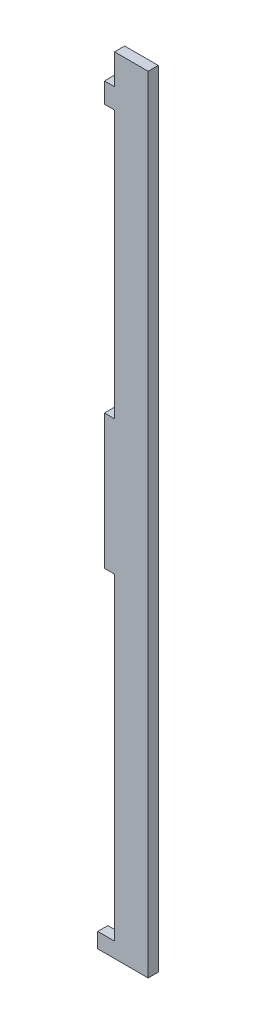
ISO-10303-21;
HEADER;
FILE_DESCRIPTION(('STEP AP214'),'2;1');
FILE_NAME('part.step','',(''),(''),'','','');
FILE_SCHEMA(('AUTOMOTIVE_DESIGN { 1 0 10303 214 1 1 1 1 }'));
ENDSEC;
DATA;
#1=APPLICATION_CONTEXT('core data for automotive mechanical design processes');
#2=APPLICATION_PROTOCOL_DEFINITION('international standard','automotive_design',2000,#1);
#3=PRODUCT_CONTEXT('',#1,'mechanical');
#4=PRODUCT('Part','Part','',(#3));
#5=PRODUCT_RELATED_PRODUCT_CATEGORY('part','',(#4));
#6=PRODUCT_DEFINITION_FORMATION('','',#4);
#7=PRODUCT_DEFINITION_CONTEXT('part definition',#1,'design');
#8=PRODUCT_DEFINITION('design','',#6,#7);
#9=PRODUCT_DEFINITION_SHAPE('','',#8);
#10=(LENGTH_UNIT() NAMED_UNIT(*) SI_UNIT(.MILLI.,.METRE.));
#11=(NAMED_UNIT(*) PLANE_ANGLE_UNIT() SI_UNIT($,.RADIAN.));
#12=(NAMED_UNIT(*) SI_UNIT($,.STERADIAN.) SOLID_ANGLE_UNIT());
#13=UNCERTAINTY_MEASURE_WITH_UNIT(LENGTH_MEASURE(1.E-05),#10,'distance_accuracy_value','');
#14=(GEOMETRIC_REPRESENTATION_CONTEXT(3) GLOBAL_UNCERTAINTY_ASSIGNED_CONTEXT((#13)) GLOBAL_UNIT_ASSIGNED_CONTEXT((#10,
#11,#12)) REPRESENTATION_CONTEXT('',''));
#15=CARTESIAN_POINT('',(0.,0.,0.));
#16=DIRECTION('',(0.,0.,1.));
#17=DIRECTION('',(1.,0.,0.));
#18=AXIS2_PLACEMENT_3D('',#15,#16,#17);
#19=CARTESIAN_POINT('',(-9.99999999999995,105.297102275896,3.));
#20=DIRECTION('',(1.,0.,0.));
#21=DIRECTION('',(0.,0.,-1.));
#22=AXIS2_PLACEMENT_3D('',#19,#20,#21);
#23=PLANE('',#22);
#24=DIRECTION('',(0.,-1.,0.));
#25=VECTOR('',#24,1.);
#26=CARTESIAN_POINT('',(-9.99999999999995,105.297102275896,0.));
#27=LINE('',#26,#25);
#28=CARTESIAN_POINT('',(-9.99999999999995,114.297102275896,0.));
#29=VERTEX_POINT('',#28);
#30=CARTESIAN_POINT('',(-9.99999999999995,105.297102275896,0.));
#31=VERTEX_POINT('',#30);
#32=EDGE_CURVE('E170',#29,#31,#27,.T.);
#33=ORIENTED_EDGE('',*,*,#32,.T.);
#34=DIRECTION('',(0.,0.,-1.));
#35=VECTOR('',#34,1.);
#36=CARTESIAN_POINT('',(-9.99999999999995,105.297102275896,3.));
#37=LINE('',#36,#35);
#38=CARTESIAN_POINT('',(-9.99999999999995,105.297102275896,3.));
#39=VERTEX_POINT('',#38);
#40=EDGE_CURVE('E11',#39,#31,#37,.T.);
#41=ORIENTED_EDGE('',*,*,#40,.F.);
#42=DIRECTION('',(0.,-1.,0.));
#43=VECTOR('',#42,1.);
#44=CARTESIAN_POINT('',(-9.99999999999995,105.297102275896,3.));
#45=LINE('',#44,#43);
#46=CARTESIAN_POINT('',(-9.99999999999995,114.297102275896,3.));
#47=VERTEX_POINT('',#46);
#48=EDGE_CURVE('E196',#47,#39,#45,.T.);
#49=ORIENTED_EDGE('',*,*,#48,.F.);
#50=DIRECTION('',(0.,0.,-1.));
#51=VECTOR('',#50,1.);
#52=CARTESIAN_POINT('',(-9.99999999999995,114.297102275896,3.));
#53=LINE('',#52,#51);
#54=EDGE_CURVE('E166',#47,#29,#53,.T.);
#55=ORIENTED_EDGE('',*,*,#54,.T.);
#56=EDGE_LOOP('',(#33,#41,#49,#55));
#57=FACE_BOUND('',#56,.T.);
#58=ADVANCED_FACE('F38',(#57),#23,.F.);
#59=CARTESIAN_POINT('',(-9.99999999999995,105.297102275896,3.));
#60=DIRECTION('',(0.,-1.,0.));
#61=DIRECTION('',(0.,0.,-1.));
#62=AXIS2_PLACEMENT_3D('',#59,#60,#61);
#63=PLANE('',#62);
#64=DIRECTION('',(-1.,0.,0.));
#65=VECTOR('',#64,1.);
#66=CARTESIAN_POINT('',(-9.99999999999995,105.297102275896,0.));
#67=LINE('',#66,#65);
#68=CARTESIAN_POINT('',(-13.,105.297102275896,0.));
#69=VERTEX_POINT('',#68);
#70=EDGE_CURVE('E173',#31,#69,#67,.T.);
#71=ORIENTED_EDGE('',*,*,#70,.T.);
#72=DIRECTION('',(0.,0.,-1.));
#73=VECTOR('',#72,1.);
#74=CARTESIAN_POINT('',(-13.,105.297102275896,3.));
#75=LINE('',#74,#73);
#76=CARTESIAN_POINT('',(-13.,105.297102275896,3.));
#77=VERTEX_POINT('',#76);
#78=EDGE_CURVE('E46',#77,#69,#75,.T.);
#79=ORIENTED_EDGE('',*,*,#78,.F.);
#80=DIRECTION('',(-1.,0.,0.));
#81=VECTOR('',#80,1.);
#82=CARTESIAN_POINT('',(-9.99999999999995,105.297102275896,3.));
#83=LINE('',#82,#81);
#84=EDGE_CURVE('E115',#39,#77,#83,.T.);
#85=ORIENTED_EDGE('',*,*,#84,.F.);
#86=ORIENTED_EDGE('',*,*,#40,.T.);
#87=EDGE_LOOP('',(#71,#79,#85,#86));
#88=FACE_BOUND('',#87,.T.);
#89=ADVANCED_FACE('F284',(#88),#63,.F.);
#90=CARTESIAN_POINT('',(-13.,105.297102275896,3.));
#91=DIRECTION('',(1.,0.,0.));
#92=DIRECTION('',(0.,0.,-1.));
#93=AXIS2_PLACEMENT_3D('',#90,#91,#92);
#94=PLANE('',#93);
#95=DIRECTION('',(0.,-1.,0.));
#96=VECTOR('',#95,1.);
#97=CARTESIAN_POINT('',(-13.,105.297102275896,0.));
#98=LINE('',#97,#96);
#99=CARTESIAN_POINT('',(-13.,99.2971022758961,0.));
#100=VERTEX_POINT('',#99);
#101=EDGE_CURVE('E175',#69,#100,#98,.T.);
#102=ORIENTED_EDGE('',*,*,#101,.T.);
#103=DIRECTION('',(0.,0.,-1.));
#104=VECTOR('',#103,1.);
#105=CARTESIAN_POINT('',(-13.,99.2971022758961,3.));
#106=LINE('',#105,#104);
#107=CARTESIAN_POINT('',(-13.,99.2971022758961,3.));
#108=VERTEX_POINT('',#107);
#109=EDGE_CURVE('E221',#108,#100,#106,.T.);
#110=ORIENTED_EDGE('',*,*,#109,.F.);
#111=DIRECTION('',(0.,-1.,0.));
#112=VECTOR('',#111,1.);
#113=CARTESIAN_POINT('',(-13.,105.297102275896,3.));
#114=LINE('',#113,#112);
#115=EDGE_CURVE('E229',#77,#108,#114,.T.);
#116=ORIENTED_EDGE('',*,*,#115,.F.);
#117=ORIENTED_EDGE('',*,*,#78,.T.);
#118=EDGE_LOOP('',(#102,#110,#116,#117));
#119=FACE_BOUND('',#118,.T.);
#120=ADVANCED_FACE('F227',(#119),#94,.F.);
#121=CARTESIAN_POINT('',(-13.,99.2971022758961,3.));
#122=DIRECTION('',(0.,1.,0.));
#123=DIRECTION('',(0.,0.,1.));
#124=AXIS2_PLACEMENT_3D('',#121,#122,#123);
#125=PLANE('',#124);
#126=DIRECTION('',(1.,0.,0.));
#127=VECTOR('',#126,1.);
#128=CARTESIAN_POINT('',(-13.,99.2971022758961,0.));
#129=LINE('',#128,#127);
#130=CARTESIAN_POINT('',(-9.99999999999995,99.2971022758961,0.));
#131=VERTEX_POINT('',#130);
#132=EDGE_CURVE('E177',#100,#131,#129,.T.);
#133=ORIENTED_EDGE('',*,*,#132,.T.);
#134=DIRECTION('',(0.,0.,-1.));
#135=VECTOR('',#134,1.);
#136=CARTESIAN_POINT('',(-9.99999999999995,99.2971022758961,3.));
#137=LINE('',#136,#135);
#138=CARTESIAN_POINT('',(-9.99999999999995,99.2971022758961,3.));
#139=VERTEX_POINT('',#138);
#140=EDGE_CURVE('E218',#139,#131,#137,.T.);
#141=ORIENTED_EDGE('',*,*,#140,.F.);
#142=DIRECTION('',(1.,0.,0.));
#143=VECTOR('',#142,1.);
#144=CARTESIAN_POINT('',(-13.,99.2971022758961,3.));
#145=LINE('',#144,#143);
#146=EDGE_CURVE('E247',#108,#139,#145,.T.);
#147=ORIENTED_EDGE('',*,*,#146,.F.);
#148=ORIENTED_EDGE('',*,*,#109,.T.);
#149=EDGE_LOOP('',(#133,#141,#147,#148));
#150=FACE_BOUND('',#149,.T.);
#151=ADVANCED_FACE('F238',(#150),#125,.F.);
#152=CARTESIAN_POINT('',(-9.99999999999995,99.2971022758961,3.));
#153=DIRECTION('',(1.,0.,0.));
#154=DIRECTION('',(0.,0.,-1.));
#155=AXIS2_PLACEMENT_3D('',#152,#153,#154);
#156=PLANE('',#155);
#157=DIRECTION('',(0.,-1.,0.));
#158=VECTOR('',#157,1.);
#159=CARTESIAN_POINT('',(-9.99999999999995,99.2971022758961,0.));
#160=LINE('',#159,#158);
#161=CARTESIAN_POINT('',(-9.99999999999995,19.797102275896,0.));
#162=VERTEX_POINT('',#161);
#163=EDGE_CURVE('E179',#131,#162,#160,.T.);
#164=ORIENTED_EDGE('',*,*,#163,.T.);
#165=DIRECTION('',(0.,0.,-1.));
#166=VECTOR('',#165,1.);
#167=CARTESIAN_POINT('',(-9.99999999999995,19.797102275896,3.));
#168=LINE('',#167,#166);
#169=CARTESIAN_POINT('',(-9.99999999999995,19.797102275896,3.));
#170=VERTEX_POINT('',#169);
#171=EDGE_CURVE('E215',#170,#162,#168,.T.);
#172=ORIENTED_EDGE('',*,*,#171,.F.);
#173=DIRECTION('',(0.,-1.,0.));
#174=VECTOR('',#173,1.);
#175=CARTESIAN_POINT('',(-9.99999999999995,99.2971022758961,3.));
#176=LINE('',#175,#174);
#177=EDGE_CURVE('E244',#139,#170,#176,.T.);
#178=ORIENTED_EDGE('',*,*,#177,.F.);
#179=ORIENTED_EDGE('',*,*,#140,.T.);
#180=EDGE_LOOP('',(#164,#172,#178,#179));
#181=FACE_BOUND('',#180,.T.);
#182=ADVANCED_FACE('F242',(#181),#156,.F.);
#183=CARTESIAN_POINT('',(-13.,19.797102275896,3.));
#184=DIRECTION('',(0.,-1.,0.));
#185=DIRECTION('',(0.,0.,-1.));
#186=AXIS2_PLACEMENT_3D('',#183,#184,#185);
#187=PLANE('',#186);
#188=DIRECTION('',(-1.,0.,0.));
#189=VECTOR('',#188,1.);
#190=CARTESIAN_POINT('',(-13.,19.797102275896,0.));
#191=LINE('',#190,#189);
#192=CARTESIAN_POINT('',(-13.,19.797102275896,0.));
#193=VERTEX_POINT('',#192);
#194=EDGE_CURVE('E181',#162,#193,#191,.T.);
#195=ORIENTED_EDGE('',*,*,#194,.T.);
#196=DIRECTION('',(0.,0.,-1.));
#197=VECTOR('',#196,1.);
#198=CARTESIAN_POINT('',(-13.,19.797102275896,3.));
#199=LINE('',#198,#197);
#200=CARTESIAN_POINT('',(-13.,19.797102275896,3.));
#201=VERTEX_POINT('',#200);
#202=EDGE_CURVE('E212',#201,#193,#199,.T.);
#203=ORIENTED_EDGE('',*,*,#202,.F.);
#204=DIRECTION('',(-1.,0.,0.));
#205=VECTOR('',#204,1.);
#206=CARTESIAN_POINT('',(-13.,19.797102275896,3.));
#207=LINE('',#206,#205);
#208=EDGE_CURVE('E246',#170,#201,#207,.T.);
#209=ORIENTED_EDGE('',*,*,#208,.F.);
#210=ORIENTED_EDGE('',*,*,#171,.T.);
#211=EDGE_LOOP('',(#195,#203,#209,#210));
#212=FACE_BOUND('',#211,.T.);
#213=ADVANCED_FACE('F297',(#212),#187,.F.);
#214=CARTESIAN_POINT('',(-13.,19.797102275896,3.));
#215=DIRECTION('',(1.,0.,0.));
#216=DIRECTION('',(0.,0.,-1.));
#217=AXIS2_PLACEMENT_3D('',#214,#215,#216);
#218=PLANE('',#217);
#219=DIRECTION('',(0.,-1.,0.));
#220=VECTOR('',#219,1.);
#221=CARTESIAN_POINT('',(-13.,19.797102275896,0.));
#222=LINE('',#221,#220);
#223=CARTESIAN_POINT('',(-13.,-20.202897724104,0.));
#224=VERTEX_POINT('',#223);
#225=EDGE_CURVE('E183',#193,#224,#222,.T.);
#226=ORIENTED_EDGE('',*,*,#225,.T.);
#227=DIRECTION('',(0.,0.,-1.));
#228=VECTOR('',#227,1.);
#229=CARTESIAN_POINT('',(-13.,-20.202897724104,3.));
#230=LINE('',#229,#228);
#231=CARTESIAN_POINT('',(-13.,-20.202897724104,3.));
#232=VERTEX_POINT('',#231);
#233=EDGE_CURVE('E209',#232,#224,#230,.T.);
#234=ORIENTED_EDGE('',*,*,#233,.F.);
#235=DIRECTION('',(0.,-1.,0.));
#236=VECTOR('',#235,1.);
#237=CARTESIAN_POINT('',(-13.,19.797102275896,3.));
#238=LINE('',#237,#236);
#239=EDGE_CURVE('E249',#201,#232,#238,.T.);
#240=ORIENTED_EDGE('',*,*,#239,.F.);
#241=ORIENTED_EDGE('',*,*,#202,.T.);
#242=EDGE_LOOP('',(#226,#234,#240,#241));
#243=FACE_BOUND('',#242,.T.);
#244=ADVANCED_FACE('F300',(#243),#218,.F.);
#245=CARTESIAN_POINT('',(-13.,-20.202897724104,3.));
#246=DIRECTION('',(0.,1.,0.));
#247=DIRECTION('',(0.,0.,1.));
#248=AXIS2_PLACEMENT_3D('',#245,#246,#247);
#249=PLANE('',#248);
#250=DIRECTION('',(1.,0.,0.));
#251=VECTOR('',#250,1.);
#252=CARTESIAN_POINT('',(-13.,-20.202897724104,0.));
#253=LINE('',#252,#251);
#254=CARTESIAN_POINT('',(-9.99999999999995,-20.202897724104,0.));
#255=VERTEX_POINT('',#254);
#256=EDGE_CURVE('E185',#224,#255,#253,.T.);
#257=ORIENTED_EDGE('',*,*,#256,.T.);
#258=DIRECTION('',(0.,0.,-1.));
#259=VECTOR('',#258,1.);
#260=CARTESIAN_POINT('',(-9.99999999999995,-20.202897724104,3.));
#261=LINE('',#260,#259);
#262=CARTESIAN_POINT('',(-9.99999999999995,-20.202897724104,3.));
#263=VERTEX_POINT('',#262);
#264=EDGE_CURVE('E206',#263,#255,#261,.T.);
#265=ORIENTED_EDGE('',*,*,#264,.F.);
#266=DIRECTION('',(1.,0.,0.));
#267=VECTOR('',#266,1.);
#268=CARTESIAN_POINT('',(-13.,-20.202897724104,3.));
#269=LINE('',#268,#267);
#270=EDGE_CURVE('E255',#232,#263,#269,.T.);
#271=ORIENTED_EDGE('',*,*,#270,.F.);
#272=ORIENTED_EDGE('',*,*,#233,.T.);
#273=EDGE_LOOP('',(#257,#265,#271,#272));
#274=FACE_BOUND('',#273,.T.);
#275=ADVANCED_FACE('F304',(#274),#249,.F.);
#276=CARTESIAN_POINT('',(-9.99999999999995,-114.702897724104,3.));
#277=DIRECTION('',(1.,0.,0.));
#278=DIRECTION('',(0.,0.,-1.));
#279=AXIS2_PLACEMENT_3D('',#276,#277,#278);
#280=PLANE('',#279);
#281=DIRECTION('',(0.,-1.,0.));
#282=VECTOR('',#281,1.);
#283=CARTESIAN_POINT('',(-9.99999999999995,-114.702897724104,0.));
#284=LINE('',#283,#282);
#285=CARTESIAN_POINT('',(-9.99999999999995,-114.702897724104,0.));
#286=VERTEX_POINT('',#285);
#287=EDGE_CURVE('E187',#255,#286,#284,.T.);
#288=ORIENTED_EDGE('',*,*,#287,.T.);
#289=DIRECTION('',(0.,0.,-1.));
#290=VECTOR('',#289,1.);
#291=CARTESIAN_POINT('',(-9.99999999999995,-114.702897724104,3.));
#292=LINE('',#291,#290);
#293=CARTESIAN_POINT('',(-9.99999999999995,-114.702897724104,3.));
#294=VERTEX_POINT('',#293);
#295=EDGE_CURVE('E203',#294,#286,#292,.T.);
#296=ORIENTED_EDGE('',*,*,#295,.F.);
#297=DIRECTION('',(0.,-1.,0.));
#298=VECTOR('',#297,1.);
#299=CARTESIAN_POINT('',(-9.99999999999995,-114.702897724104,3.));
#300=LINE('',#299,#298);
#301=EDGE_CURVE('E257',#263,#294,#300,.T.);
#302=ORIENTED_EDGE('',*,*,#301,.F.);
#303=ORIENTED_EDGE('',*,*,#264,.T.);
#304=EDGE_LOOP('',(#288,#296,#302,#303));
#305=FACE_BOUND('',#304,.T.);
#306=ADVANCED_FACE('F308',(#305),#280,.F.);
#307=CARTESIAN_POINT('',(-15.,-114.702897724104,3.));
#308=DIRECTION('',(0.,-1.,0.));
#309=DIRECTION('',(0.,0.,-1.));
#310=AXIS2_PLACEMENT_3D('',#307,#308,#309);
#311=PLANE('',#310);
#312=DIRECTION('',(-1.,0.,0.));
#313=VECTOR('',#312,1.);
#314=CARTESIAN_POINT('',(-15.,-114.702897724104,0.));
#315=LINE('',#314,#313);
#316=CARTESIAN_POINT('',(-15.,-114.702897724104,0.));
#317=VERTEX_POINT('',#316);
#318=EDGE_CURVE('E189',#286,#317,#315,.T.);
#319=ORIENTED_EDGE('',*,*,#318,.T.);
#320=DIRECTION('',(0.,0.,-1.));
#321=VECTOR('',#320,1.);
#322=CARTESIAN_POINT('',(-15.,-114.702897724104,3.));
#323=LINE('',#322,#321);
#324=CARTESIAN_POINT('',(-15.,-114.702897724104,3.));
#325=VERTEX_POINT('',#324);
#326=EDGE_CURVE('E200',#325,#317,#323,.T.);
#327=ORIENTED_EDGE('',*,*,#326,.F.);
#328=DIRECTION('',(-1.,0.,0.));
#329=VECTOR('',#328,1.);
#330=CARTESIAN_POINT('',(-15.,-114.702897724104,3.));
#331=LINE('',#330,#329);
#332=EDGE_CURVE('E259',#294,#325,#331,.T.);
#333=ORIENTED_EDGE('',*,*,#332,.F.);
#334=ORIENTED_EDGE('',*,*,#295,.T.);
#335=EDGE_LOOP('',(#319,#327,#333,#334));
#336=FACE_BOUND('',#335,.T.);
#337=ADVANCED_FACE('F265',(#336),#311,.F.);
#338=CARTESIAN_POINT('',(-15.,-119.202897724104,3.));
#339=DIRECTION('',(1.,0.,0.));
#340=DIRECTION('',(0.,0.,-1.));
#341=AXIS2_PLACEMENT_3D('',#338,#339,#340);
#342=PLANE('',#341);
#343=DIRECTION('',(0.,-1.,0.));
#344=VECTOR('',#343,1.);
#345=CARTESIAN_POINT('',(-15.,-119.202897724104,0.));
#346=LINE('',#345,#344);
#347=CARTESIAN_POINT('',(-15.,-119.202897724104,0.));
#348=VERTEX_POINT('',#347);
#349=EDGE_CURVE('E191',#317,#348,#346,.T.);
#350=ORIENTED_EDGE('',*,*,#349,.T.);
#351=DIRECTION('',(0.,0.,-1.));
#352=VECTOR('',#351,1.);
#353=CARTESIAN_POINT('',(-15.,-119.202897724104,3.));
#354=LINE('',#353,#352);
#355=CARTESIAN_POINT('',(-15.,-119.202897724104,3.));
#356=VERTEX_POINT('',#355);
#357=EDGE_CURVE('E161',#356,#348,#354,.T.);
#358=ORIENTED_EDGE('',*,*,#357,.F.);
#359=DIRECTION('',(0.,-1.,0.));
#360=VECTOR('',#359,1.);
#361=CARTESIAN_POINT('',(-15.,-119.202897724104,3.));
#362=LINE('',#361,#360);
#363=EDGE_CURVE('E152',#325,#356,#362,.T.);
#364=ORIENTED_EDGE('',*,*,#363,.F.);
#365=ORIENTED_EDGE('',*,*,#326,.T.);
#366=EDGE_LOOP('',(#350,#358,#364,#365));
#367=FACE_BOUND('',#366,.T.);
#368=ADVANCED_FACE('F269',(#367),#342,.F.);
#369=CARTESIAN_POINT('',(0.,-119.202897724104,3.));
#370=DIRECTION('',(0.,1.,0.));
#371=DIRECTION('',(0.,0.,1.));
#372=AXIS2_PLACEMENT_3D('',#369,#370,#371);
#373=PLANE('',#372);
#374=DIRECTION('',(1.,0.,0.));
#375=VECTOR('',#374,1.);
#376=CARTESIAN_POINT('',(0.,-119.202897724104,0.));
#377=LINE('',#376,#375);
#378=CARTESIAN_POINT('',(0.,-119.202897724104,0.));
#379=VERTEX_POINT('',#378);
#380=EDGE_CURVE('E160',#348,#379,#377,.T.);
#381=ORIENTED_EDGE('',*,*,#380,.T.);
#382=DIRECTION('',(0.,0.,-1.));
#383=VECTOR('',#382,1.);
#384=CARTESIAN_POINT('',(0.,-119.202897724104,3.));
#385=LINE('',#384,#383);
#386=CARTESIAN_POINT('',(0.,-119.202897724104,3.));
#387=VERTEX_POINT('',#386);
#388=EDGE_CURVE('E157',#387,#379,#385,.T.);
#389=ORIENTED_EDGE('',*,*,#388,.F.);
#390=DIRECTION('',(1.,0.,0.));
#391=VECTOR('',#390,1.);
#392=CARTESIAN_POINT('',(0.,-119.202897724104,3.));
#393=LINE('',#392,#391);
#394=EDGE_CURVE('E146',#356,#387,#393,.T.);
#395=ORIENTED_EDGE('',*,*,#394,.F.);
#396=ORIENTED_EDGE('',*,*,#357,.T.);
#397=EDGE_LOOP('',(#381,#389,#395,#396));
#398=FACE_BOUND('',#397,.T.);
#399=ADVANCED_FACE('F158',(#398),#373,.F.);
#400=CARTESIAN_POINT('',(0.,114.297102275896,3.));
#401=DIRECTION('',(-1.,0.,0.));
#402=DIRECTION('',(0.,-1.,0.));
#403=AXIS2_PLACEMENT_3D('',#400,#401,#402);
#404=PLANE('',#403);
#405=DIRECTION('',(0.,1.,0.));
#406=VECTOR('',#405,1.);
#407=CARTESIAN_POINT('',(0.,114.297102275896,0.));
#408=LINE('',#407,#406);
#409=CARTESIAN_POINT('',(0.,114.297102275896,0.));
#410=VERTEX_POINT('',#409);
#411=EDGE_CURVE('E101',#379,#410,#408,.T.);
#412=ORIENTED_EDGE('',*,*,#411,.T.);
#413=DIRECTION('',(0.,0.,-1.));
#414=VECTOR('',#413,1.);
#415=CARTESIAN_POINT('',(0.,114.297102275896,3.));
#416=LINE('',#415,#414);
#417=CARTESIAN_POINT('',(0.,114.297102275896,3.));
#418=VERTEX_POINT('',#417);
#419=EDGE_CURVE('E162',#418,#410,#416,.T.);
#420=ORIENTED_EDGE('',*,*,#419,.F.);
#421=DIRECTION('',(0.,1.,0.));
#422=VECTOR('',#421,1.);
#423=CARTESIAN_POINT('',(0.,114.297102275896,3.));
#424=LINE('',#423,#422);
#425=EDGE_CURVE('E150',#387,#418,#424,.T.);
#426=ORIENTED_EDGE('',*,*,#425,.F.);
#427=ORIENTED_EDGE('',*,*,#388,.T.);
#428=EDGE_LOOP('',(#412,#420,#426,#427));
#429=FACE_BOUND('',#428,.T.);
#430=ADVANCED_FACE('F164',(#429),#404,.F.);
#431=CARTESIAN_POINT('',(-9.99999999999995,114.297102275896,3.));
#432=DIRECTION('',(0.,-1.,0.));
#433=DIRECTION('',(0.,0.,-1.));
#434=AXIS2_PLACEMENT_3D('',#431,#432,#433);
#435=PLANE('',#434);
#436=DIRECTION('',(-1.,0.,0.));
#437=VECTOR('',#436,1.);
#438=CARTESIAN_POINT('',(-9.99999999999995,114.297102275896,0.));
#439=LINE('',#438,#437);
#440=EDGE_CURVE('E107',#410,#29,#439,.T.);
#441=ORIENTED_EDGE('',*,*,#440,.T.);
#442=ORIENTED_EDGE('',*,*,#54,.F.);
#443=DIRECTION('',(-1.,0.,0.));
#444=VECTOR('',#443,1.);
#445=CARTESIAN_POINT('',(-9.99999999999995,114.297102275896,3.));
#446=LINE('',#445,#444);
#447=EDGE_CURVE('E54',#418,#47,#446,.T.);
#448=ORIENTED_EDGE('',*,*,#447,.F.);
#449=ORIENTED_EDGE('',*,*,#419,.T.);
#450=EDGE_LOOP('',(#441,#442,#448,#449));
#451=FACE_BOUND('',#450,.T.);
#452=ADVANCED_FACE('F273',(#451),#435,.F.);
#453=CARTESIAN_POINT('',(0.,0.,3.));
#454=DIRECTION('',(0.,0.,-1.));
#455=DIRECTION('',(-1.,0.,0.));
#456=AXIS2_PLACEMENT_3D('',#453,#454,#455);
#457=PLANE('',#456);
#458=ORIENTED_EDGE('',*,*,#48,.T.);
#459=ORIENTED_EDGE('',*,*,#84,.T.);
#460=ORIENTED_EDGE('',*,*,#115,.T.);
#461=ORIENTED_EDGE('',*,*,#146,.T.);
#462=ORIENTED_EDGE('',*,*,#177,.T.);
#463=ORIENTED_EDGE('',*,*,#208,.T.);
#464=ORIENTED_EDGE('',*,*,#239,.T.);
#465=ORIENTED_EDGE('',*,*,#270,.T.);
#466=ORIENTED_EDGE('',*,*,#301,.T.);
#467=ORIENTED_EDGE('',*,*,#332,.T.);
#468=ORIENTED_EDGE('',*,*,#363,.T.);
#469=ORIENTED_EDGE('',*,*,#394,.T.);
#470=ORIENTED_EDGE('',*,*,#425,.T.);
#471=ORIENTED_EDGE('',*,*,#447,.T.);
#472=EDGE_LOOP('',(#458,#459,#460,#461,#462,#463,#464,#465,#466,#467,#468,#469,#470,#471));
#473=FACE_BOUND('',#472,.T.);
#474=ADVANCED_FACE('F148',(#473),#457,.F.);
#475=CARTESIAN_POINT('',(0.,0.,0.));
#476=DIRECTION('',(0.,0.,-1.));
#477=DIRECTION('',(-1.,0.,0.));
#478=AXIS2_PLACEMENT_3D('',#475,#476,#477);
#479=PLANE('',#478);
#480=ORIENTED_EDGE('',*,*,#32,.F.);
#481=ORIENTED_EDGE('',*,*,#440,.F.);
#482=ORIENTED_EDGE('',*,*,#411,.F.);
#483=ORIENTED_EDGE('',*,*,#380,.F.);
#484=ORIENTED_EDGE('',*,*,#349,.F.);
#485=ORIENTED_EDGE('',*,*,#318,.F.);
#486=ORIENTED_EDGE('',*,*,#287,.F.);
#487=ORIENTED_EDGE('',*,*,#256,.F.);
#488=ORIENTED_EDGE('',*,*,#225,.F.);
#489=ORIENTED_EDGE('',*,*,#194,.F.);
#490=ORIENTED_EDGE('',*,*,#163,.F.);
#491=ORIENTED_EDGE('',*,*,#132,.F.);
#492=ORIENTED_EDGE('',*,*,#101,.F.);
#493=ORIENTED_EDGE('',*,*,#70,.F.);
#494=EDGE_LOOP('',(#480,#481,#482,#483,#484,#485,#486,#487,#488,#489,#490,#491,#492,#493));
#495=FACE_BOUND('',#494,.T.);
#496=ADVANCED_FACE('F233',(#495),#479,.T.);
#497=CLOSED_SHELL('',(#58,#89,#120,#151,#182,#213,#244,#275,#306,#337,#368,#399,#430,#452,#474,#496));
#498=MANIFOLD_SOLID_BREP('B2',#497);
#499=ADVANCED_BREP_SHAPE_REPRESENTATION('',(#18,#498),#14);
#500=SHAPE_DEFINITION_REPRESENTATION(#9,#499);
ENDSEC;
END-ISO-10303-21;
